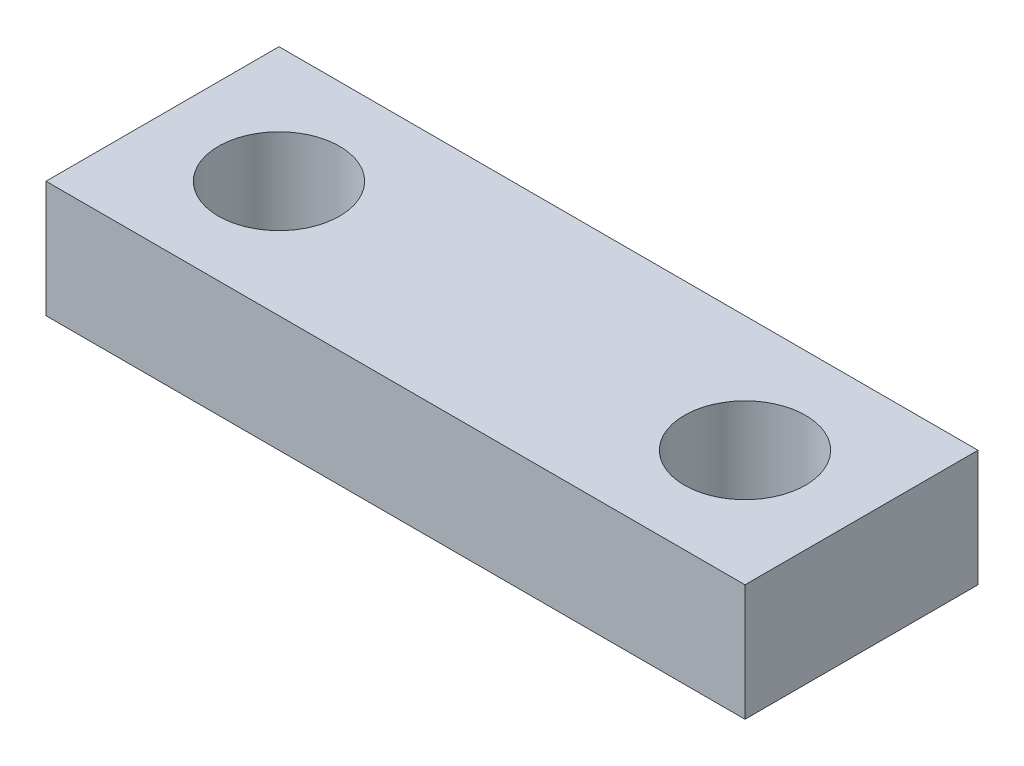
ISO-10303-21;
HEADER;
FILE_DESCRIPTION(('STEP AP214'),'2;1');
FILE_NAME('part.step','',(''),(''),'','','');
FILE_SCHEMA(('AUTOMOTIVE_DESIGN { 1 0 10303 214 1 1 1 1 }'));
ENDSEC;
DATA;
#1=APPLICATION_CONTEXT('core data for automotive mechanical design processes');
#2=APPLICATION_PROTOCOL_DEFINITION('international standard','automotive_design',2000,#1);
#3=PRODUCT_CONTEXT('',#1,'mechanical');
#4=PRODUCT('Part','Part','',(#3));
#5=PRODUCT_RELATED_PRODUCT_CATEGORY('part','',(#4));
#6=PRODUCT_DEFINITION_FORMATION('','',#4);
#7=PRODUCT_DEFINITION_CONTEXT('part definition',#1,'design');
#8=PRODUCT_DEFINITION('design','',#6,#7);
#9=PRODUCT_DEFINITION_SHAPE('','',#8);
#10=(LENGTH_UNIT() NAMED_UNIT(*) SI_UNIT(.MILLI.,.METRE.));
#11=(NAMED_UNIT(*) PLANE_ANGLE_UNIT() SI_UNIT($,.RADIAN.));
#12=(NAMED_UNIT(*) SI_UNIT($,.STERADIAN.) SOLID_ANGLE_UNIT());
#13=UNCERTAINTY_MEASURE_WITH_UNIT(LENGTH_MEASURE(1.E-05),#10,'distance_accuracy_value','');
#14=(GEOMETRIC_REPRESENTATION_CONTEXT(3) GLOBAL_UNCERTAINTY_ASSIGNED_CONTEXT((#13)) GLOBAL_UNIT_ASSIGNED_CONTEXT((#10,
#11,#12)) REPRESENTATION_CONTEXT('',''));
#15=CARTESIAN_POINT('',(0.,0.,0.));
#16=DIRECTION('',(0.,0.,1.));
#17=DIRECTION('',(1.,0.,0.));
#18=AXIS2_PLACEMENT_3D('',#15,#16,#17);
#19=CARTESIAN_POINT('',(0.,6.35,0.));
#20=DIRECTION('',(0.,-1.,0.));
#21=DIRECTION('',(0.,0.,-1.));
#22=AXIS2_PLACEMENT_3D('',#19,#20,#21);
#23=PLANE('',#22);
#24=DIRECTION('',(0.,0.,1.));
#25=VECTOR('',#24,1.);
#26=CARTESIAN_POINT('',(0.,6.35,0.));
#27=LINE('',#26,#25);
#28=CARTESIAN_POINT('',(0.,6.35,-12.7));
#29=VERTEX_POINT('',#28);
#30=CARTESIAN_POINT('',(0.,6.35,0.));
#31=VERTEX_POINT('',#30);
#32=EDGE_CURVE('E92',#29,#31,#27,.T.);
#33=ORIENTED_EDGE('',*,*,#32,.T.);
#34=DIRECTION('',(1.,0.,0.));
#35=VECTOR('',#34,1.);
#36=CARTESIAN_POINT('',(0.,6.35,0.));
#37=LINE('',#36,#35);
#38=CARTESIAN_POINT('',(38.1,6.35,0.));
#39=VERTEX_POINT('',#38);
#40=EDGE_CURVE('E87',#31,#39,#37,.T.);
#41=ORIENTED_EDGE('',*,*,#40,.T.);
#42=DIRECTION('',(0.,0.,-1.));
#43=VECTOR('',#42,1.);
#44=CARTESIAN_POINT('',(38.1,6.35,0.));
#45=LINE('',#44,#43);
#46=CARTESIAN_POINT('',(38.1,6.35,-12.7));
#47=VERTEX_POINT('',#46);
#48=EDGE_CURVE('E90',#39,#47,#45,.T.);
#49=ORIENTED_EDGE('',*,*,#48,.T.);
#50=DIRECTION('',(-1.,0.,0.));
#51=VECTOR('',#50,1.);
#52=CARTESIAN_POINT('',(0.,6.35,-12.7));
#53=LINE('',#52,#51);
#54=EDGE_CURVE('E57',#47,#29,#53,.T.);
#55=ORIENTED_EDGE('',*,*,#54,.T.);
#56=EDGE_LOOP('',(#33,#41,#49,#55));
#57=FACE_BOUND('',#56,.T.);
#58=CARTESIAN_POINT('',(6.35,6.35,-6.35));
#59=DIRECTION('',(0.,1.,0.));
#60=DIRECTION('',(0.,0.,1.));
#61=AXIS2_PLACEMENT_3D('',#58,#59,#60);
#62=CIRCLE('',#61,3.302);
#63=CARTESIAN_POINT('',(6.35,6.35,-3.048));
#64=VERTEX_POINT('',#63);
#65=EDGE_CURVE('E112',#64,#64,#62,.T.);
#66=ORIENTED_EDGE('',*,*,#65,.F.);
#67=EDGE_LOOP('',(#66));
#68=FACE_BOUND('',#67,.T.);
#69=CARTESIAN_POINT('',(31.75,6.35,-6.35));
#70=DIRECTION('',(0.,1.,0.));
#71=DIRECTION('',(0.,0.,1.));
#72=AXIS2_PLACEMENT_3D('',#69,#70,#71);
#73=CIRCLE('',#72,3.302);
#74=CARTESIAN_POINT('',(31.75,6.35,-3.048));
#75=VERTEX_POINT('',#74);
#76=EDGE_CURVE('E134',#75,#75,#73,.T.);
#77=ORIENTED_EDGE('',*,*,#76,.F.);
#78=EDGE_LOOP('',(#77));
#79=FACE_BOUND('',#78,.T.);
#80=ADVANCED_FACE('F39',(#57,#68,#79),#23,.F.);
#81=CARTESIAN_POINT('',(0.,0.,0.));
#82=DIRECTION('',(0.,-1.,0.));
#83=DIRECTION('',(0.,0.,-1.));
#84=AXIS2_PLACEMENT_3D('',#81,#82,#83);
#85=PLANE('',#84);
#86=CARTESIAN_POINT('',(6.35,0.,-6.35));
#87=DIRECTION('',(0.,1.,0.));
#88=DIRECTION('',(0.,0.,1.));
#89=AXIS2_PLACEMENT_3D('',#86,#87,#88);
#90=CIRCLE('',#89,3.302);
#91=CARTESIAN_POINT('',(6.35,0.,-3.048));
#92=VERTEX_POINT('',#91);
#93=EDGE_CURVE('E130',#92,#92,#90,.T.);
#94=ORIENTED_EDGE('',*,*,#93,.T.);
#95=EDGE_LOOP('',(#94));
#96=FACE_BOUND('',#95,.T.);
#97=DIRECTION('',(0.,0.,1.));
#98=VECTOR('',#97,1.);
#99=CARTESIAN_POINT('',(0.,0.,0.));
#100=LINE('',#99,#98);
#101=CARTESIAN_POINT('',(0.,0.,-12.7));
#102=VERTEX_POINT('',#101);
#103=CARTESIAN_POINT('',(0.,0.,0.));
#104=VERTEX_POINT('',#103);
#105=EDGE_CURVE('E108',#102,#104,#100,.T.);
#106=ORIENTED_EDGE('',*,*,#105,.F.);
#107=DIRECTION('',(-1.,0.,0.));
#108=VECTOR('',#107,1.);
#109=CARTESIAN_POINT('',(0.,0.,-12.7));
#110=LINE('',#109,#108);
#111=CARTESIAN_POINT('',(38.1,0.,-12.7));
#112=VERTEX_POINT('',#111);
#113=EDGE_CURVE('E80',#112,#102,#110,.T.);
#114=ORIENTED_EDGE('',*,*,#113,.F.);
#115=DIRECTION('',(0.,0.,-1.));
#116=VECTOR('',#115,1.);
#117=CARTESIAN_POINT('',(38.1,0.,0.));
#118=LINE('',#117,#116);
#119=CARTESIAN_POINT('',(38.1,0.,0.));
#120=VERTEX_POINT('',#119);
#121=EDGE_CURVE('E74',#120,#112,#118,.T.);
#122=ORIENTED_EDGE('',*,*,#121,.F.);
#123=DIRECTION('',(1.,0.,0.));
#124=VECTOR('',#123,1.);
#125=CARTESIAN_POINT('',(0.,0.,0.));
#126=LINE('',#125,#124);
#127=EDGE_CURVE('E97',#104,#120,#126,.T.);
#128=ORIENTED_EDGE('',*,*,#127,.F.);
#129=EDGE_LOOP('',(#106,#114,#122,#128));
#130=FACE_BOUND('',#129,.T.);
#131=CARTESIAN_POINT('',(31.75,0.,-6.35));
#132=DIRECTION('',(0.,1.,0.));
#133=DIRECTION('',(0.,0.,1.));
#134=AXIS2_PLACEMENT_3D('',#131,#132,#133);
#135=CIRCLE('',#134,3.302);
#136=CARTESIAN_POINT('',(31.75,0.,-3.048));
#137=VERTEX_POINT('',#136);
#138=EDGE_CURVE('E138',#137,#137,#135,.T.);
#139=ORIENTED_EDGE('',*,*,#138,.T.);
#140=EDGE_LOOP('',(#139));
#141=FACE_BOUND('',#140,.T.);
#142=ADVANCED_FACE('F125',(#96,#130,#141),#85,.T.);
#143=CARTESIAN_POINT('',(0.,6.35,0.));
#144=DIRECTION('',(1.,0.,0.));
#145=DIRECTION('',(0.,0.,-1.));
#146=AXIS2_PLACEMENT_3D('',#143,#144,#145);
#147=PLANE('',#146);
#148=ORIENTED_EDGE('',*,*,#105,.T.);
#149=DIRECTION('',(0.,-1.,0.));
#150=VECTOR('',#149,1.);
#151=CARTESIAN_POINT('',(0.,6.35,0.));
#152=LINE('',#151,#150);
#153=EDGE_CURVE('E11',#31,#104,#152,.T.);
#154=ORIENTED_EDGE('',*,*,#153,.F.);
#155=ORIENTED_EDGE('',*,*,#32,.F.);
#156=DIRECTION('',(0.,-1.,0.));
#157=VECTOR('',#156,1.);
#158=CARTESIAN_POINT('',(0.,6.35,-12.7));
#159=LINE('',#158,#157);
#160=EDGE_CURVE('E104',#29,#102,#159,.T.);
#161=ORIENTED_EDGE('',*,*,#160,.T.);
#162=EDGE_LOOP('',(#148,#154,#155,#161));
#163=FACE_BOUND('',#162,.T.);
#164=ADVANCED_FACE('F41',(#163),#147,.F.);
#165=CARTESIAN_POINT('',(0.,6.35,0.));
#166=DIRECTION('',(0.,0.,-1.));
#167=DIRECTION('',(-1.,0.,0.));
#168=AXIS2_PLACEMENT_3D('',#165,#166,#167);
#169=PLANE('',#168);
#170=ORIENTED_EDGE('',*,*,#127,.T.);
#171=DIRECTION('',(0.,-1.,0.));
#172=VECTOR('',#171,1.);
#173=CARTESIAN_POINT('',(38.1,6.35,0.));
#174=LINE('',#173,#172);
#175=EDGE_CURVE('E49',#39,#120,#174,.T.);
#176=ORIENTED_EDGE('',*,*,#175,.F.);
#177=ORIENTED_EDGE('',*,*,#40,.F.);
#178=ORIENTED_EDGE('',*,*,#153,.T.);
#179=EDGE_LOOP('',(#170,#176,#177,#178));
#180=FACE_BOUND('',#179,.T.);
#181=ADVANCED_FACE('F96',(#180),#169,.F.);
#182=CARTESIAN_POINT('',(38.1,6.35,0.));
#183=DIRECTION('',(-1.,0.,0.));
#184=DIRECTION('',(0.,0.,1.));
#185=AXIS2_PLACEMENT_3D('',#182,#183,#184);
#186=PLANE('',#185);
#187=ORIENTED_EDGE('',*,*,#121,.T.);
#188=DIRECTION('',(0.,-1.,0.));
#189=VECTOR('',#188,1.);
#190=CARTESIAN_POINT('',(38.1,6.35,-12.7));
#191=LINE('',#190,#189);
#192=EDGE_CURVE('E99',#47,#112,#191,.T.);
#193=ORIENTED_EDGE('',*,*,#192,.F.);
#194=ORIENTED_EDGE('',*,*,#48,.F.);
#195=ORIENTED_EDGE('',*,*,#175,.T.);
#196=EDGE_LOOP('',(#187,#193,#194,#195));
#197=FACE_BOUND('',#196,.T.);
#198=ADVANCED_FACE('F100',(#197),#186,.F.);
#199=CARTESIAN_POINT('',(0.,6.35,-12.7));
#200=DIRECTION('',(0.,0.,1.));
#201=DIRECTION('',(1.,0.,0.));
#202=AXIS2_PLACEMENT_3D('',#199,#200,#201);
#203=PLANE('',#202);
#204=ORIENTED_EDGE('',*,*,#113,.T.);
#205=ORIENTED_EDGE('',*,*,#160,.F.);
#206=ORIENTED_EDGE('',*,*,#54,.F.);
#207=ORIENTED_EDGE('',*,*,#192,.T.);
#208=EDGE_LOOP('',(#204,#205,#206,#207));
#209=FACE_BOUND('',#208,.T.);
#210=ADVANCED_FACE('F122',(#209),#203,.F.);
#211=CARTESIAN_POINT('',(6.35,6.35,-6.35));
#212=DIRECTION('',(0.,-1.,0.));
#213=DIRECTION('',(0.,0.,-1.));
#214=AXIS2_PLACEMENT_3D('',#211,#212,#213);
#215=CYLINDRICAL_SURFACE('',#214,3.302);
#216=ORIENTED_EDGE('',*,*,#65,.T.);
#217=EDGE_LOOP('',(#216));
#218=FACE_BOUND('',#217,.T.);
#219=ORIENTED_EDGE('',*,*,#93,.F.);
#220=EDGE_LOOP('',(#219));
#221=FACE_BOUND('',#220,.T.);
#222=ADVANCED_FACE('F157',(#218,#221),#215,.F.);
#223=CARTESIAN_POINT('',(31.75,6.35,-6.35));
#224=DIRECTION('',(0.,-1.,0.));
#225=DIRECTION('',(0.,0.,-1.));
#226=AXIS2_PLACEMENT_3D('',#223,#224,#225);
#227=CYLINDRICAL_SURFACE('',#226,3.302);
#228=ORIENTED_EDGE('',*,*,#76,.T.);
#229=EDGE_LOOP('',(#228));
#230=FACE_BOUND('',#229,.T.);
#231=ORIENTED_EDGE('',*,*,#138,.F.);
#232=EDGE_LOOP('',(#231));
#233=FACE_BOUND('',#232,.T.);
#234=ADVANCED_FACE('F146',(#230,#233),#227,.F.);
#235=CLOSED_SHELL('',(#80,#142,#164,#181,#198,#210,#222,#234));
#236=MANIFOLD_SOLID_BREP('B2',#235);
#237=ADVANCED_BREP_SHAPE_REPRESENTATION('',(#18,#236),#14);
#238=SHAPE_DEFINITION_REPRESENTATION(#9,#237);
ENDSEC;
END-ISO-10303-21;
